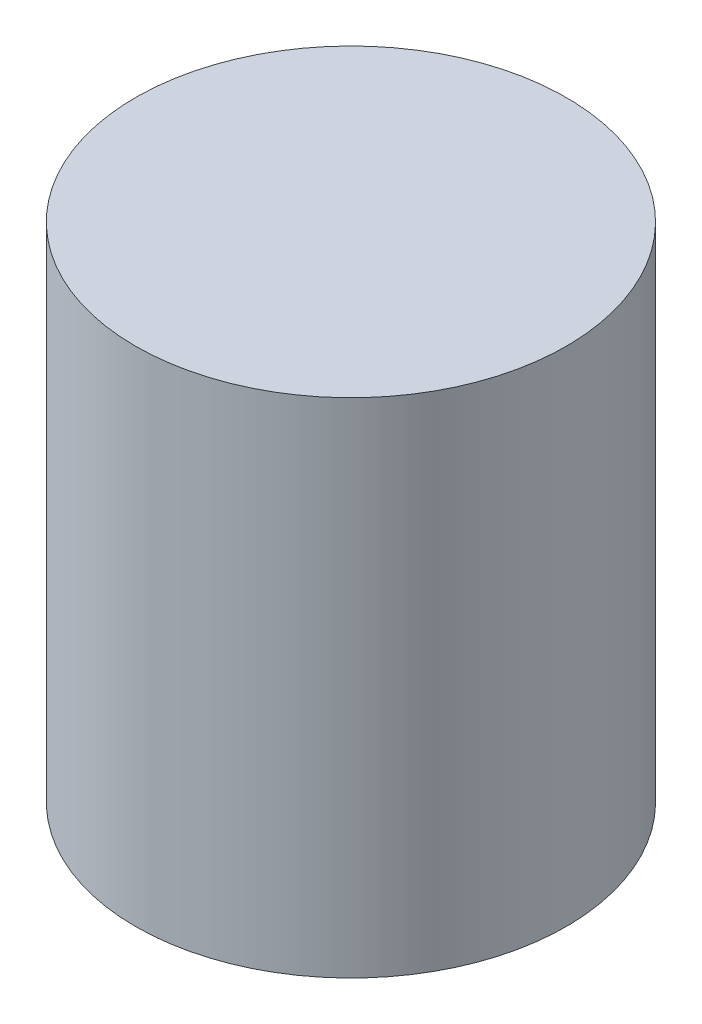
ISO-10303-21;
HEADER;
FILE_DESCRIPTION(('STEP AP214'),'2;1');
FILE_NAME('part.step','',(''),(''),'','','');
FILE_SCHEMA(('AUTOMOTIVE_DESIGN { 1 0 10303 214 1 1 1 1 }'));
ENDSEC;
DATA;
#1=APPLICATION_CONTEXT('core data for automotive mechanical design processes');
#2=APPLICATION_PROTOCOL_DEFINITION('international standard','automotive_design',2000,#1);
#3=PRODUCT_CONTEXT('',#1,'mechanical');
#4=PRODUCT('Part','Part','',(#3));
#5=PRODUCT_RELATED_PRODUCT_CATEGORY('part','',(#4));
#6=PRODUCT_DEFINITION_FORMATION('','',#4);
#7=PRODUCT_DEFINITION_CONTEXT('part definition',#1,'design');
#8=PRODUCT_DEFINITION('design','',#6,#7);
#9=PRODUCT_DEFINITION_SHAPE('','',#8);
#10=(LENGTH_UNIT() NAMED_UNIT(*) SI_UNIT(.MILLI.,.METRE.));
#11=(NAMED_UNIT(*) PLANE_ANGLE_UNIT() SI_UNIT($,.RADIAN.));
#12=(NAMED_UNIT(*) SI_UNIT($,.STERADIAN.) SOLID_ANGLE_UNIT());
#13=UNCERTAINTY_MEASURE_WITH_UNIT(LENGTH_MEASURE(1.E-05),#10,'distance_accuracy_value','');
#14=(GEOMETRIC_REPRESENTATION_CONTEXT(3) GLOBAL_UNCERTAINTY_ASSIGNED_CONTEXT((#13)) GLOBAL_UNIT_ASSIGNED_CONTEXT((#10,
#11,#12)) REPRESENTATION_CONTEXT('',''));
#15=CARTESIAN_POINT('',(0.,0.,0.));
#16=DIRECTION('',(0.,0.,1.));
#17=DIRECTION('',(1.,0.,0.));
#18=AXIS2_PLACEMENT_3D('',#15,#16,#17);
#19=CARTESIAN_POINT('',(0.,7.,0.));
#20=DIRECTION('',(0.,-1.,0.));
#21=DIRECTION('',(0.,0.,-1.));
#22=AXIS2_PLACEMENT_3D('',#19,#20,#21);
#23=CYLINDRICAL_SURFACE('',#22,3.);
#24=CARTESIAN_POINT('',(0.,7.,0.));
#25=DIRECTION('',(0.,1.,0.));
#26=DIRECTION('',(0.,0.,1.));
#27=AXIS2_PLACEMENT_3D('',#24,#25,#26);
#28=CIRCLE('',#27,3.);
#29=CARTESIAN_POINT('',(0.,7.,3.));
#30=VERTEX_POINT('',#29);
#31=EDGE_CURVE('E10',#30,#30,#28,.T.);
#32=ORIENTED_EDGE('',*,*,#31,.F.);
#33=EDGE_LOOP('',(#32));
#34=FACE_BOUND('',#33,.T.);
#35=CARTESIAN_POINT('',(0.,0.,0.));
#36=DIRECTION('',(0.,1.,0.));
#37=DIRECTION('',(0.,0.,1.));
#38=AXIS2_PLACEMENT_3D('',#35,#36,#37);
#39=CIRCLE('',#38,3.);
#40=CARTESIAN_POINT('',(0.,0.,3.));
#41=VERTEX_POINT('',#40);
#42=EDGE_CURVE('E36',#41,#41,#39,.T.);
#43=ORIENTED_EDGE('',*,*,#42,.T.);
#44=EDGE_LOOP('',(#43));
#45=FACE_BOUND('',#44,.T.);
#46=ADVANCED_FACE('F33',(#34,#45),#23,.T.);
#47=CARTESIAN_POINT('',(0.,7.,0.));
#48=DIRECTION('',(0.,1.,0.));
#49=DIRECTION('',(0.,0.,1.));
#50=AXIS2_PLACEMENT_3D('',#47,#48,#49);
#51=PLANE('',#50);
#52=ORIENTED_EDGE('',*,*,#31,.T.);
#53=EDGE_LOOP('',(#52));
#54=FACE_BOUND('',#53,.T.);
#55=ADVANCED_FACE('F48',(#54),#51,.T.);
#56=CARTESIAN_POINT('',(0.,0.,0.));
#57=DIRECTION('',(0.,1.,0.));
#58=DIRECTION('',(0.,0.,1.));
#59=AXIS2_PLACEMENT_3D('',#56,#57,#58);
#60=PLANE('',#59);
#61=ORIENTED_EDGE('',*,*,#42,.F.);
#62=EDGE_LOOP('',(#61));
#63=FACE_BOUND('',#62,.T.);
#64=ADVANCED_FACE('F46',(#63),#60,.F.);
#65=CLOSED_SHELL('',(#46,#55,#64));
#66=MANIFOLD_SOLID_BREP('B2',#65);
#67=ADVANCED_BREP_SHAPE_REPRESENTATION('',(#18,#66),#14);
#68=SHAPE_DEFINITION_REPRESENTATION(#9,#67);
ENDSEC;
END-ISO-10303-21;
